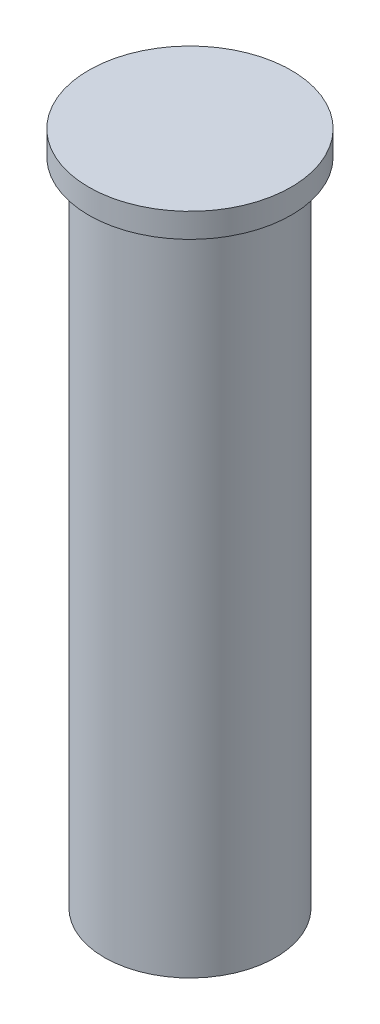
ISO-10303-21;
HEADER;
FILE_DESCRIPTION(('STEP AP214'),'2;1');
FILE_NAME('part.step','',(''),(''),'','','');
FILE_SCHEMA(('AUTOMOTIVE_DESIGN { 1 0 10303 214 1 1 1 1 }'));
ENDSEC;
DATA;
#1=APPLICATION_CONTEXT('core data for automotive mechanical design processes');
#2=APPLICATION_PROTOCOL_DEFINITION('international standard','automotive_design',2000,#1);
#3=PRODUCT_CONTEXT('',#1,'mechanical');
#4=PRODUCT('Part','Part','',(#3));
#5=PRODUCT_RELATED_PRODUCT_CATEGORY('part','',(#4));
#6=PRODUCT_DEFINITION_FORMATION('','',#4);
#7=PRODUCT_DEFINITION_CONTEXT('part definition',#1,'design');
#8=PRODUCT_DEFINITION('design','',#6,#7);
#9=PRODUCT_DEFINITION_SHAPE('','',#8);
#10=(LENGTH_UNIT() NAMED_UNIT(*) SI_UNIT(.MILLI.,.METRE.));
#11=(NAMED_UNIT(*) PLANE_ANGLE_UNIT() SI_UNIT($,.RADIAN.));
#12=(NAMED_UNIT(*) SI_UNIT($,.STERADIAN.) SOLID_ANGLE_UNIT());
#13=UNCERTAINTY_MEASURE_WITH_UNIT(LENGTH_MEASURE(1.E-05),#10,'distance_accuracy_value','');
#14=(GEOMETRIC_REPRESENTATION_CONTEXT(3) GLOBAL_UNCERTAINTY_ASSIGNED_CONTEXT((#13)) GLOBAL_UNIT_ASSIGNED_CONTEXT((#10,
#11,#12)) REPRESENTATION_CONTEXT('',''));
#15=CARTESIAN_POINT('',(0.,0.,0.));
#16=DIRECTION('',(0.,0.,1.));
#17=DIRECTION('',(1.,0.,0.));
#18=AXIS2_PLACEMENT_3D('',#15,#16,#17);
#19=CARTESIAN_POINT('',(0.,1.143,0.));
#20=DIRECTION('',(0.,-1.,0.));
#21=DIRECTION('',(0.,0.,-1.));
#22=AXIS2_PLACEMENT_3D('',#19,#20,#21);
#23=CYLINDRICAL_SURFACE('',#22,4.7625);
#24=CARTESIAN_POINT('',(0.,1.143,0.));
#25=DIRECTION('',(0.,1.,0.));
#26=DIRECTION('',(0.,0.,1.));
#27=AXIS2_PLACEMENT_3D('',#24,#25,#26);
#28=CIRCLE('',#27,4.7625);
#29=CARTESIAN_POINT('',(0.,1.143,4.7625));
#30=VERTEX_POINT('',#29);
#31=EDGE_CURVE('E11',#30,#30,#28,.T.);
#32=ORIENTED_EDGE('',*,*,#31,.F.);
#33=EDGE_LOOP('',(#32));
#34=FACE_BOUND('',#33,.T.);
#35=CARTESIAN_POINT('',(0.,0.,0.));
#36=DIRECTION('',(0.,1.,0.));
#37=DIRECTION('',(0.,0.,1.));
#38=AXIS2_PLACEMENT_3D('',#35,#36,#37);
#39=CIRCLE('',#38,4.7625);
#40=CARTESIAN_POINT('',(0.,0.,4.7625));
#41=VERTEX_POINT('',#40);
#42=EDGE_CURVE('E44',#41,#41,#39,.T.);
#43=ORIENTED_EDGE('',*,*,#42,.T.);
#44=EDGE_LOOP('',(#43));
#45=FACE_BOUND('',#44,.T.);
#46=ADVANCED_FACE('F37',(#34,#45),#23,.T.);
#47=CARTESIAN_POINT('',(0.,1.143,0.));
#48=DIRECTION('',(0.,1.,0.));
#49=DIRECTION('',(0.,0.,1.));
#50=AXIS2_PLACEMENT_3D('',#47,#48,#49);
#51=PLANE('',#50);
#52=ORIENTED_EDGE('',*,*,#31,.T.);
#53=EDGE_LOOP('',(#52));
#54=FACE_BOUND('',#53,.T.);
#55=ADVANCED_FACE('F86',(#54),#51,.T.);
#56=CARTESIAN_POINT('',(0.,0.,0.));
#57=DIRECTION('',(0.,1.,0.));
#58=DIRECTION('',(0.,0.,1.));
#59=AXIS2_PLACEMENT_3D('',#56,#57,#58);
#60=PLANE('',#59);
#61=CARTESIAN_POINT('',(0.,0.,0.));
#62=DIRECTION('',(0.,1.,0.));
#63=DIRECTION('',(0.,0.,1.));
#64=AXIS2_PLACEMENT_3D('',#61,#62,#63);
#65=CIRCLE('',#64,4.0259);
#66=CARTESIAN_POINT('',(0.,0.,4.0259));
#67=VERTEX_POINT('',#66);
#68=EDGE_CURVE('E40',#67,#67,#65,.T.);
#69=ORIENTED_EDGE('',*,*,#68,.T.);
#70=EDGE_LOOP('',(#69));
#71=FACE_BOUND('',#70,.T.);
#72=ORIENTED_EDGE('',*,*,#42,.F.);
#73=EDGE_LOOP('',(#72));
#74=FACE_BOUND('',#73,.T.);
#75=ADVANCED_FACE('F73',(#71,#74),#60,.F.);
#76=CARTESIAN_POINT('',(0.,-30.607,0.));
#77=DIRECTION('',(0.,1.,0.));
#78=DIRECTION('',(0.,0.,1.));
#79=AXIS2_PLACEMENT_3D('',#76,#77,#78);
#80=CYLINDRICAL_SURFACE('',#79,4.0259);
#81=CARTESIAN_POINT('',(0.,-30.607,0.));
#82=DIRECTION('',(0.,1.,0.));
#83=DIRECTION('',(0.,0.,1.));
#84=AXIS2_PLACEMENT_3D('',#81,#82,#83);
#85=CIRCLE('',#84,4.0259);
#86=CARTESIAN_POINT('',(0.,-30.607,4.0259));
#87=VERTEX_POINT('',#86);
#88=EDGE_CURVE('E58',#87,#87,#85,.T.);
#89=ORIENTED_EDGE('',*,*,#88,.T.);
#90=EDGE_LOOP('',(#89));
#91=FACE_BOUND('',#90,.T.);
#92=ORIENTED_EDGE('',*,*,#68,.F.);
#93=EDGE_LOOP('',(#92));
#94=FACE_BOUND('',#93,.T.);
#95=ADVANCED_FACE('F76',(#91,#94),#80,.T.);
#96=CARTESIAN_POINT('',(0.,-30.607,0.));
#97=DIRECTION('',(0.,1.,0.));
#98=DIRECTION('',(0.,0.,1.));
#99=AXIS2_PLACEMENT_3D('',#96,#97,#98);
#100=PLANE('',#99);
#101=CARTESIAN_POINT('',(0.,-30.607,0.));
#102=DIRECTION('',(0.,-1.,0.));
#103=DIRECTION('',(0.,0.,-1.));
#104=AXIS2_PLACEMENT_3D('',#101,#102,#103);
#105=CIRCLE('',#104,2.7178);
#106=CARTESIAN_POINT('',(0.,-30.607,-2.7178));
#107=VERTEX_POINT('',#106);
#108=EDGE_CURVE('E64',#107,#107,#105,.T.);
#109=ORIENTED_EDGE('',*,*,#108,.F.);
#110=EDGE_LOOP('',(#109));
#111=FACE_BOUND('',#110,.T.);
#112=ORIENTED_EDGE('',*,*,#88,.F.);
#113=EDGE_LOOP('',(#112));
#114=FACE_BOUND('',#113,.T.);
#115=ADVANCED_FACE('F52',(#111,#114),#100,.F.);
#116=CARTESIAN_POINT('',(0.,-11.557,0.));
#117=DIRECTION('',(0.,-1.,0.));
#118=DIRECTION('',(0.,0.,-1.));
#119=AXIS2_PLACEMENT_3D('',#116,#117,#118);
#120=CONICAL_SURFACE('',#119,1.7272,1.02974425867665);
#121=CARTESIAN_POINT('',(0.,-10.5191935388156,0.));
#122=VERTEX_POINT('',#121);
#123=VERTEX_LOOP('',#122);
#124=FACE_BOUND('',#123,.T.);
#125=CARTESIAN_POINT('',(0.,-11.557,0.));
#126=DIRECTION('',(0.,-1.,0.));
#127=DIRECTION('',(0.,0.,-1.));
#128=AXIS2_PLACEMENT_3D('',#125,#126,#127);
#129=CIRCLE('',#128,1.7272);
#130=CARTESIAN_POINT('',(0.,-11.557,-1.7272));
#131=VERTEX_POINT('',#130);
#132=EDGE_CURVE('E56',#131,#131,#129,.T.);
#133=ORIENTED_EDGE('',*,*,#132,.T.);
#134=EDGE_LOOP('',(#133));
#135=FACE_BOUND('',#134,.T.);
#136=ADVANCED_FACE('F48',(#124,#135),#120,.F.);
#137=CARTESIAN_POINT('',(0.,-30.607,0.));
#138=DIRECTION('',(0.,-1.,0.));
#139=DIRECTION('',(0.,0.,-1.));
#140=AXIS2_PLACEMENT_3D('',#137,#138,#139);
#141=CYLINDRICAL_SURFACE('',#140,1.7272);
#142=ORIENTED_EDGE('',*,*,#132,.F.);
#143=EDGE_LOOP('',(#142));
#144=FACE_BOUND('',#143,.T.);
#145=CARTESIAN_POINT('',(0.,-28.2154800451132,0.));
#146=DIRECTION('',(0.,-1.,0.));
#147=DIRECTION('',(0.,0.,-1.));
#148=AXIS2_PLACEMENT_3D('',#145,#146,#147);
#149=CIRCLE('',#148,1.7272);
#150=CARTESIAN_POINT('',(0.,-28.2154800451132,-1.7272));
#151=VERTEX_POINT('',#150);
#152=EDGE_CURVE('E59',#151,#151,#149,.T.);
#153=ORIENTED_EDGE('',*,*,#152,.T.);
#154=EDGE_LOOP('',(#153));
#155=FACE_BOUND('',#154,.T.);
#156=ADVANCED_FACE('F51',(#144,#155),#141,.F.);
#157=CARTESIAN_POINT('',(0.,-30.607,0.));
#158=DIRECTION('',(0.,-1.,0.));
#159=DIRECTION('',(0.,0.,-1.));
#160=AXIS2_PLACEMENT_3D('',#157,#158,#159);
#161=CONICAL_SURFACE('',#160,2.7178,0.392699081698724);
#162=ORIENTED_EDGE('',*,*,#152,.F.);
#163=EDGE_LOOP('',(#162));
#164=FACE_BOUND('',#163,.T.);
#165=ORIENTED_EDGE('',*,*,#108,.T.);
#166=EDGE_LOOP('',(#165));
#167=FACE_BOUND('',#166,.T.);
#168=ADVANCED_FACE('F127',(#164,#167),#161,.F.);
#169=CLOSED_SHELL('',(#46,#55,#75,#95,#115,#136,#156,#168));
#170=MANIFOLD_SOLID_BREP('B2',#169);
#171=ADVANCED_BREP_SHAPE_REPRESENTATION('',(#18,#170),#14);
#172=SHAPE_DEFINITION_REPRESENTATION(#9,#171);
ENDSEC;
END-ISO-10303-21;
